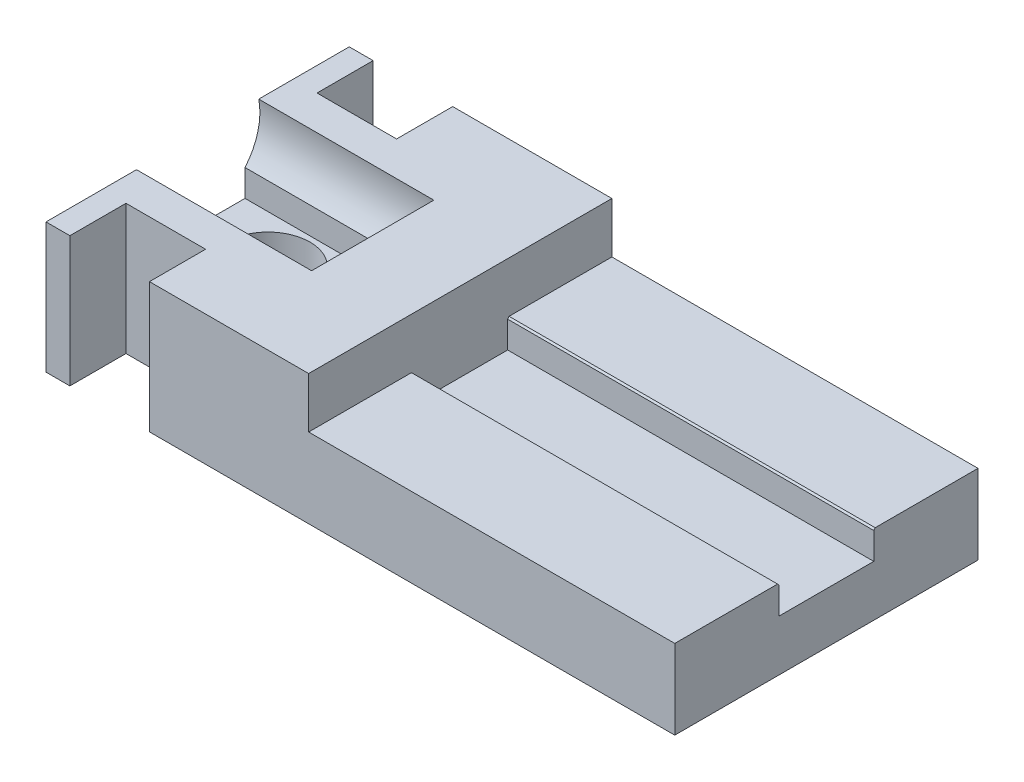
ISO-10303-21;
HEADER;
FILE_DESCRIPTION(('STEP AP214'),'2;1');
FILE_NAME('part.step','',(''),(''),'','','');
FILE_SCHEMA(('AUTOMOTIVE_DESIGN { 1 0 10303 214 1 1 1 1 }'));
ENDSEC;
DATA;
#1=APPLICATION_CONTEXT('core data for automotive mechanical design processes');
#2=APPLICATION_PROTOCOL_DEFINITION('international standard','automotive_design',2000,#1);
#3=PRODUCT_CONTEXT('',#1,'mechanical');
#4=PRODUCT('Part','Part','',(#3));
#5=PRODUCT_RELATED_PRODUCT_CATEGORY('part','',(#4));
#6=PRODUCT_DEFINITION_FORMATION('','',#4);
#7=PRODUCT_DEFINITION_CONTEXT('part definition',#1,'design');
#8=PRODUCT_DEFINITION('design','',#6,#7);
#9=PRODUCT_DEFINITION_SHAPE('','',#8);
#10=(LENGTH_UNIT() NAMED_UNIT(*) SI_UNIT(.MILLI.,.METRE.));
#11=(NAMED_UNIT(*) PLANE_ANGLE_UNIT() SI_UNIT($,.RADIAN.));
#12=(NAMED_UNIT(*) SI_UNIT($,.STERADIAN.) SOLID_ANGLE_UNIT());
#13=UNCERTAINTY_MEASURE_WITH_UNIT(LENGTH_MEASURE(1.E-05),#10,'distance_accuracy_value','');
#14=(GEOMETRIC_REPRESENTATION_CONTEXT(3) GLOBAL_UNCERTAINTY_ASSIGNED_CONTEXT((#13)) GLOBAL_UNIT_ASSIGNED_CONTEXT((#10,
#11,#12)) REPRESENTATION_CONTEXT('',''));
#15=CARTESIAN_POINT('',(0.,0.,0.));
#16=DIRECTION('',(0.,0.,1.));
#17=DIRECTION('',(1.,0.,0.));
#18=AXIS2_PLACEMENT_3D('',#15,#16,#17);
#19=CARTESIAN_POINT('',(-78.,8.49653046712334,-1.07552855510562E-13));
#20=DIRECTION('',(1.,0.,0.));
#21=DIRECTION('',(0.,0.,-1.));
#22=AXIS2_PLACEMENT_3D('',#19,#20,#21);
#23=CYLINDRICAL_SURFACE('',#22,7.8252375772589);
#24=CARTESIAN_POINT('',(-45.,8.49653046712334,-1.07552855510562E-13));
#25=DIRECTION('',(-1.,0.,0.));
#26=DIRECTION('',(0.,0.,1.));
#27=AXIS2_PLACEMENT_3D('',#24,#25,#26);
#28=CIRCLE('',#27,7.8252375772589);
#29=CARTESIAN_POINT('',(-45.,3.41853191527432,-5.95384529929736));
#30=VERTEX_POINT('',#29);
#31=CARTESIAN_POINT('',(-45.,3.63553216923717,-6.13229473268318));
#32=VERTEX_POINT('',#31);
#33=EDGE_CURVE('E205',#30,#32,#28,.F.);
#34=ORIENTED_EDGE('',*,*,#33,.F.);
#35=DIRECTION('',(1.,0.,0.));
#36=VECTOR('',#35,1.);
#37=CARTESIAN_POINT('',(-78.,3.41853191527432,-5.95384529929736));
#38=LINE('',#37,#36);
#39=CARTESIAN_POINT('',(1.,3.41853191527432,-5.95384529929736));
#40=VERTEX_POINT('',#39);
#41=EDGE_CURVE('E212',#40,#30,#38,.F.);
#42=ORIENTED_EDGE('',*,*,#41,.F.);
#43=CARTESIAN_POINT('',(1.,8.49653046712334,-1.07552855510562E-13));
#44=DIRECTION('',(1.,0.,0.));
#45=DIRECTION('',(0.,0.,-1.));
#46=AXIS2_PLACEMENT_3D('',#43,#44,#45);
#47=CIRCLE('',#46,7.8252375772589);
#48=CARTESIAN_POINT('',(1.,3.63553216923717,-6.13229473268318));
#49=VERTEX_POINT('',#48);
#50=EDGE_CURVE('E308',#40,#49,#47,.T.);
#51=ORIENTED_EDGE('',*,*,#50,.T.);
#52=DIRECTION('',(1.,0.,0.));
#53=VECTOR('',#52,1.);
#54=CARTESIAN_POINT('',(-78.,3.63553216923717,-6.13229473268318));
#55=LINE('',#54,#53);
#56=EDGE_CURVE('E215',#32,#49,#55,.T.);
#57=ORIENTED_EDGE('',*,*,#56,.F.);
#58=EDGE_LOOP('',(#34,#42,#51,#57));
#59=FACE_BOUND('',#58,.T.);
#60=ADVANCED_FACE('F32',(#59),#23,.F.);
#61=CARTESIAN_POINT('',(-45.,8.49653046712334,-1.07552855510562E-13));
#62=DIRECTION('',(-1.,0.,0.));
#63=DIRECTION('',(0.,0.,1.));
#64=AXIS2_PLACEMENT_3D('',#61,#62,#63);
#65=CIRCLE('',#64,7.8252375772589);
#66=CARTESIAN_POINT('',(-45.,3.63553216923717,6.13229473268296));
#67=VERTEX_POINT('',#66);
#68=CARTESIAN_POINT('',(-45.,3.41853191527457,5.95384529929736));
#69=VERTEX_POINT('',#68);
#70=EDGE_CURVE('E217',#67,#69,#65,.F.);
#71=ORIENTED_EDGE('',*,*,#70,.F.);
#72=DIRECTION('',(1.,0.,0.));
#73=VECTOR('',#72,1.);
#74=CARTESIAN_POINT('',(-78.,3.63553216923717,6.13229473268296));
#75=LINE('',#74,#73);
#76=CARTESIAN_POINT('',(1.,3.63553216923717,6.13229473268296));
#77=VERTEX_POINT('',#76);
#78=EDGE_CURVE('E312',#77,#67,#75,.F.);
#79=ORIENTED_EDGE('',*,*,#78,.F.);
#80=CARTESIAN_POINT('',(1.,3.41853191527457,5.95384529929736));
#81=VERTEX_POINT('',#80);
#82=EDGE_CURVE('E309',#77,#81,#47,.T.);
#83=ORIENTED_EDGE('',*,*,#82,.T.);
#84=DIRECTION('',(1.,0.,0.));
#85=VECTOR('',#84,1.);
#86=CARTESIAN_POINT('',(-78.,3.41853191527457,5.95384529929736));
#87=LINE('',#86,#85);
#88=EDGE_CURVE('E235',#81,#69,#87,.F.);
#89=ORIENTED_EDGE('',*,*,#88,.T.);
#90=EDGE_LOOP('',(#71,#79,#83,#89));
#91=FACE_BOUND('',#90,.T.);
#92=ADVANCED_FACE('F495',(#91),#23,.F.);
#93=CARTESIAN_POINT('',(1.,0.,5.95384529929736));
#94=DIRECTION('',(0.,0.,1.));
#95=DIRECTION('',(1.,0.,0.));
#96=AXIS2_PLACEMENT_3D('',#93,#94,#95);
#97=PLANE('',#96);
#98=DIRECTION('',(0.,-1.,0.));
#99=VECTOR('',#98,1.);
#100=CARTESIAN_POINT('',(-45.,0.,5.95384529929736));
#101=LINE('',#100,#99);
#102=CARTESIAN_POINT('',(-45.,0.0584346301053529,5.95384529929736));
#103=VERTEX_POINT('',#102);
#104=EDGE_CURVE('E422',#69,#103,#101,.T.);
#105=ORIENTED_EDGE('',*,*,#104,.F.);
#106=ORIENTED_EDGE('',*,*,#88,.F.);
#107=DIRECTION('',(0.,1.,0.));
#108=VECTOR('',#107,1.);
#109=CARTESIAN_POINT('',(1.,0.,5.95384529929736));
#110=LINE('',#109,#108);
#111=CARTESIAN_POINT('',(1.,0.0584346301053529,5.95384529929736));
#112=VERTEX_POINT('',#111);
#113=EDGE_CURVE('E369',#112,#81,#110,.T.);
#114=ORIENTED_EDGE('',*,*,#113,.F.);
#115=DIRECTION('',(-1.,0.,0.));
#116=VECTOR('',#115,1.);
#117=CARTESIAN_POINT('',(1.,0.0584346301053529,5.95384529929736));
#118=LINE('',#117,#116);
#119=EDGE_CURVE('E389',#112,#103,#118,.T.);
#120=ORIENTED_EDGE('',*,*,#119,.T.);
#121=EDGE_LOOP('',(#105,#106,#114,#120));
#122=FACE_BOUND('',#121,.T.);
#123=ADVANCED_FACE('F500',(#122),#97,.F.);
#124=CARTESIAN_POINT('',(1.,0.0584346301053529,0.));
#125=DIRECTION('',(0.,1.,0.));
#126=DIRECTION('',(0.,0.,1.));
#127=AXIS2_PLACEMENT_3D('',#124,#125,#126);
#128=PLANE('',#127);
#129=DIRECTION('',(-1.,0.,0.));
#130=VECTOR('',#129,1.);
#131=CARTESIAN_POINT('',(1.,0.0584346301053529,-5.95384529929736));
#132=LINE('',#131,#130);
#133=CARTESIAN_POINT('',(1.,0.0584346301053529,-5.95384529929736));
#134=VERTEX_POINT('',#133);
#135=CARTESIAN_POINT('',(-45.,0.0584346301053529,-5.95384529929736));
#136=VERTEX_POINT('',#135);
#137=EDGE_CURVE('E54',#134,#136,#132,.T.);
#138=ORIENTED_EDGE('',*,*,#137,.T.);
#139=DIRECTION('',(0.,0.,1.));
#140=VECTOR('',#139,1.);
#141=CARTESIAN_POINT('',(-45.,0.0584346301053529,0.));
#142=LINE('',#141,#140);
#143=EDGE_CURVE('E47',#136,#103,#142,.T.);
#144=ORIENTED_EDGE('',*,*,#143,.T.);
#145=ORIENTED_EDGE('',*,*,#119,.F.);
#146=DIRECTION('',(0.,0.,-1.));
#147=VECTOR('',#146,1.);
#148=CARTESIAN_POINT('',(1.,0.0584346301053529,0.));
#149=LINE('',#148,#147);
#150=EDGE_CURVE('E384',#112,#134,#149,.T.);
#151=ORIENTED_EDGE('',*,*,#150,.T.);
#152=EDGE_LOOP('',(#138,#144,#145,#151));
#153=FACE_BOUND('',#152,.T.);
#154=ADVANCED_FACE('F518',(#153),#128,.T.);
#155=CARTESIAN_POINT('',(1.,0.,-5.95384529929736));
#156=DIRECTION('',(0.,0.,1.));
#157=DIRECTION('',(1.,0.,0.));
#158=AXIS2_PLACEMENT_3D('',#155,#156,#157);
#159=PLANE('',#158);
#160=ORIENTED_EDGE('',*,*,#41,.T.);
#161=DIRECTION('',(0.,-1.,0.));
#162=VECTOR('',#161,1.);
#163=CARTESIAN_POINT('',(-45.,0.,-5.95384529929736));
#164=LINE('',#163,#162);
#165=EDGE_CURVE('E40',#30,#136,#164,.T.);
#166=ORIENTED_EDGE('',*,*,#165,.T.);
#167=ORIENTED_EDGE('',*,*,#137,.F.);
#168=DIRECTION('',(0.,1.,0.));
#169=VECTOR('',#168,1.);
#170=CARTESIAN_POINT('',(1.,0.,-5.95384529929736));
#171=LINE('',#170,#169);
#172=EDGE_CURVE('E221',#134,#40,#171,.T.);
#173=ORIENTED_EDGE('',*,*,#172,.T.);
#174=EDGE_LOOP('',(#160,#166,#167,#173));
#175=FACE_BOUND('',#174,.T.);
#176=ADVANCED_FACE('F219',(#175),#159,.T.);
#177=CARTESIAN_POINT('',(-56.,3.41853191527432,-5.95384529929736));
#178=VERTEX_POINT('',#177);
#179=CARTESIAN_POINT('',(-78.,3.41853191527432,-5.95384529929736));
#180=VERTEX_POINT('',#179);
#181=EDGE_CURVE('E223',#178,#180,#38,.F.);
#182=ORIENTED_EDGE('',*,*,#181,.F.);
#183=CARTESIAN_POINT('',(-56.,8.49653046712334,-1.07552855510562E-13));
#184=DIRECTION('',(-1.,0.,0.));
#185=DIRECTION('',(0.,0.,1.));
#186=AXIS2_PLACEMENT_3D('',#183,#184,#185);
#187=CIRCLE('',#186,7.8252375772589);
#188=CARTESIAN_POINT('',(-56.,10.,-7.6794480598711));
#189=VERTEX_POINT('',#188);
#190=EDGE_CURVE('E365',#178,#189,#187,.F.);
#191=ORIENTED_EDGE('',*,*,#190,.T.);
#192=DIRECTION('',(1.,0.,0.));
#193=VECTOR('',#192,1.);
#194=CARTESIAN_POINT('',(-78.,10.,-7.6794480598711));
#195=LINE('',#194,#193);
#196=CARTESIAN_POINT('',(-78.,10.,-7.6794480598711));
#197=VERTEX_POINT('',#196);
#198=EDGE_CURVE('E353',#197,#189,#195,.T.);
#199=ORIENTED_EDGE('',*,*,#198,.F.);
#200=CARTESIAN_POINT('',(-78.,8.49653046712334,-1.07552855510562E-13));
#201=DIRECTION('',(1.,0.,0.));
#202=DIRECTION('',(0.,0.,-1.));
#203=AXIS2_PLACEMENT_3D('',#200,#201,#202);
#204=CIRCLE('',#203,7.8252375772589);
#205=EDGE_CURVE('E283',#180,#197,#204,.T.);
#206=ORIENTED_EDGE('',*,*,#205,.F.);
#207=EDGE_LOOP('',(#182,#191,#199,#206));
#208=FACE_BOUND('',#207,.T.);
#209=ADVANCED_FACE('F432',(#208),#23,.F.);
#210=CARTESIAN_POINT('',(-78.,-6.35,19.05));
#211=DIRECTION('',(0.,0.,1.));
#212=DIRECTION('',(0.,-1.,0.));
#213=AXIS2_PLACEMENT_3D('',#210,#211,#212);
#214=PLANE('',#213);
#215=DIRECTION('',(0.,-1.,0.));
#216=VECTOR('',#215,1.);
#217=CARTESIAN_POINT('',(-75.,-6.35,19.05));
#218=LINE('',#217,#216);
#219=CARTESIAN_POINT('',(-75.,10.,19.05));
#220=VERTEX_POINT('',#219);
#221=CARTESIAN_POINT('',(-75.,-6.35,19.05));
#222=VERTEX_POINT('',#221);
#223=EDGE_CURVE('E281',#220,#222,#218,.T.);
#224=ORIENTED_EDGE('',*,*,#223,.F.);
#225=DIRECTION('',(1.,0.,0.));
#226=VECTOR('',#225,1.);
#227=CARTESIAN_POINT('',(-78.,10.,19.05));
#228=LINE('',#227,#226);
#229=CARTESIAN_POINT('',(-78.,10.,19.05));
#230=VERTEX_POINT('',#229);
#231=EDGE_CURVE('E292',#230,#220,#228,.T.);
#232=ORIENTED_EDGE('',*,*,#231,.F.);
#233=DIRECTION('',(0.,-1.,0.));
#234=VECTOR('',#233,1.);
#235=CARTESIAN_POINT('',(-78.,-6.35,19.05));
#236=LINE('',#235,#234);
#237=CARTESIAN_POINT('',(-78.,-6.35,19.05));
#238=VERTEX_POINT('',#237);
#239=EDGE_CURVE('E339',#230,#238,#236,.T.);
#240=ORIENTED_EDGE('',*,*,#239,.T.);
#241=DIRECTION('',(1.,0.,0.));
#242=VECTOR('',#241,1.);
#243=CARTESIAN_POINT('',(-78.,-6.35,19.05));
#244=LINE('',#243,#242);
#245=EDGE_CURVE('E342',#238,#222,#244,.T.);
#246=ORIENTED_EDGE('',*,*,#245,.T.);
#247=EDGE_LOOP('',(#224,#232,#240,#246));
#248=FACE_BOUND('',#247,.T.);
#249=ADVANCED_FACE('F444',(#248),#214,.T.);
#250=CARTESIAN_POINT('',(-78.,-6.34999999999999,-19.05));
#251=DIRECTION('',(0.,0.,-1.));
#252=DIRECTION('',(0.,1.,0.));
#253=AXIS2_PLACEMENT_3D('',#250,#251,#252);
#254=PLANE('',#253);
#255=DIRECTION('',(0.,1.,0.));
#256=VECTOR('',#255,1.);
#257=CARTESIAN_POINT('',(-75.,-6.34999999999999,-19.05));
#258=LINE('',#257,#256);
#259=CARTESIAN_POINT('',(-75.,-6.35,-19.05));
#260=VERTEX_POINT('',#259);
#261=CARTESIAN_POINT('',(-75.,10.,-19.05));
#262=VERTEX_POINT('',#261);
#263=EDGE_CURVE('E208',#260,#262,#258,.T.);
#264=ORIENTED_EDGE('',*,*,#263,.F.);
#265=DIRECTION('',(1.,0.,0.));
#266=VECTOR('',#265,1.);
#267=CARTESIAN_POINT('',(-78.,-6.34999999999999,-19.05));
#268=LINE('',#267,#266);
#269=CARTESIAN_POINT('',(-78.,-6.34999999999999,-19.05));
#270=VERTEX_POINT('',#269);
#271=EDGE_CURVE('E347',#270,#260,#268,.T.);
#272=ORIENTED_EDGE('',*,*,#271,.F.);
#273=DIRECTION('',(0.,1.,0.));
#274=VECTOR('',#273,1.);
#275=CARTESIAN_POINT('',(-78.,-6.34999999999999,-19.05));
#276=LINE('',#275,#274);
#277=CARTESIAN_POINT('',(-78.,10.,-19.05));
#278=VERTEX_POINT('',#277);
#279=EDGE_CURVE('E336',#270,#278,#276,.T.);
#280=ORIENTED_EDGE('',*,*,#279,.T.);
#281=DIRECTION('',(-1.,0.,0.));
#282=VECTOR('',#281,1.);
#283=CARTESIAN_POINT('',(-78.,10.,-19.05));
#284=LINE('',#283,#282);
#285=EDGE_CURVE('E297',#262,#278,#284,.T.);
#286=ORIENTED_EDGE('',*,*,#285,.F.);
#287=EDGE_LOOP('',(#264,#272,#280,#286));
#288=FACE_BOUND('',#287,.T.);
#289=ADVANCED_FACE('F482',(#288),#254,.T.);
#290=DIRECTION('',(1.,0.,0.));
#291=VECTOR('',#290,1.);
#292=CARTESIAN_POINT('',(-78.,10.,7.67944805987088));
#293=LINE('',#292,#291);
#294=CARTESIAN_POINT('',(-56.,10.,7.67944805987088));
#295=VERTEX_POINT('',#294);
#296=CARTESIAN_POINT('',(-78.,10.,7.67944805987089));
#297=VERTEX_POINT('',#296);
#298=EDGE_CURVE('E351',#295,#297,#293,.F.);
#299=ORIENTED_EDGE('',*,*,#298,.F.);
#300=CARTESIAN_POINT('',(-56.,8.49653046712334,-1.07552855510562E-13));
#301=DIRECTION('',(-1.,0.,0.));
#302=DIRECTION('',(0.,0.,1.));
#303=AXIS2_PLACEMENT_3D('',#300,#301,#302);
#304=CIRCLE('',#303,7.8252375772589);
#305=CARTESIAN_POINT('',(-56.,3.41853191527457,5.95384529929736));
#306=VERTEX_POINT('',#305);
#307=EDGE_CURVE('E372',#295,#306,#304,.F.);
#308=ORIENTED_EDGE('',*,*,#307,.T.);
#309=CARTESIAN_POINT('',(-78.,3.41853191527457,5.95384529929736));
#310=VERTEX_POINT('',#309);
#311=EDGE_CURVE('E234',#306,#310,#87,.F.);
#312=ORIENTED_EDGE('',*,*,#311,.T.);
#313=EDGE_CURVE('E284',#297,#310,#204,.T.);
#314=ORIENTED_EDGE('',*,*,#313,.F.);
#315=EDGE_LOOP('',(#299,#308,#312,#314));
#316=FACE_BOUND('',#315,.T.);
#317=ADVANCED_FACE('F414',(#316),#23,.F.);
#318=CARTESIAN_POINT('',(-68.,3.63553216923717,-19.05));
#319=DIRECTION('',(0.,-1.,0.));
#320=DIRECTION('',(0.,0.,-1.));
#321=AXIS2_PLACEMENT_3D('',#318,#319,#320);
#322=PLANE('',#321);
#323=DIRECTION('',(0.,0.,-1.));
#324=VECTOR('',#323,1.);
#325=CARTESIAN_POINT('',(-45.,3.63553216923717,-19.05));
#326=LINE('',#325,#324);
#327=CARTESIAN_POINT('',(-45.,3.63553216923717,-19.05));
#328=VERTEX_POINT('',#327);
#329=EDGE_CURVE('E306',#32,#328,#326,.T.);
#330=ORIENTED_EDGE('',*,*,#329,.F.);
#331=ORIENTED_EDGE('',*,*,#56,.T.);
#332=DIRECTION('',(0.,0.,1.));
#333=VECTOR('',#332,1.);
#334=CARTESIAN_POINT('',(1.,3.63553216923717,-19.05));
#335=LINE('',#334,#333);
#336=CARTESIAN_POINT('',(1.,3.63553216923717,-19.05));
#337=VERTEX_POINT('',#336);
#338=EDGE_CURVE('E321',#337,#49,#335,.T.);
#339=ORIENTED_EDGE('',*,*,#338,.F.);
#340=DIRECTION('',(1.,0.,0.));
#341=VECTOR('',#340,1.);
#342=CARTESIAN_POINT('',(-68.,3.63553216923717,-19.05));
#343=LINE('',#342,#341);
#344=EDGE_CURVE('E317',#328,#337,#343,.T.);
#345=ORIENTED_EDGE('',*,*,#344,.F.);
#346=EDGE_LOOP('',(#330,#331,#339,#345));
#347=FACE_BOUND('',#346,.T.);
#348=ADVANCED_FACE('F505',(#347),#322,.F.);
#349=DIRECTION('',(0.,0.,-1.));
#350=VECTOR('',#349,1.);
#351=CARTESIAN_POINT('',(-45.,3.63553216923717,-19.05));
#352=LINE('',#351,#350);
#353=CARTESIAN_POINT('',(-45.,3.63553216923717,19.05));
#354=VERTEX_POINT('',#353);
#355=EDGE_CURVE('E345',#354,#67,#352,.T.);
#356=ORIENTED_EDGE('',*,*,#355,.F.);
#357=DIRECTION('',(1.,0.,0.));
#358=VECTOR('',#357,1.);
#359=CARTESIAN_POINT('',(-68.,3.63553216923717,19.05));
#360=LINE('',#359,#358);
#361=CARTESIAN_POINT('',(1.,3.63553216923717,19.05));
#362=VERTEX_POINT('',#361);
#363=EDGE_CURVE('E316',#354,#362,#360,.T.);
#364=ORIENTED_EDGE('',*,*,#363,.T.);
#365=EDGE_CURVE('E319',#77,#362,#335,.T.);
#366=ORIENTED_EDGE('',*,*,#365,.F.);
#367=ORIENTED_EDGE('',*,*,#78,.T.);
#368=EDGE_LOOP('',(#356,#364,#366,#367));
#369=FACE_BOUND('',#368,.T.);
#370=ADVANCED_FACE('F510',(#369),#322,.F.);
#371=CARTESIAN_POINT('',(-65.,-6.35,19.05));
#372=VERTEX_POINT('',#371);
#373=CARTESIAN_POINT('',(1.,-6.35,19.05));
#374=VERTEX_POINT('',#373);
#375=EDGE_CURVE('E346',#372,#374,#244,.T.);
#376=ORIENTED_EDGE('',*,*,#375,.T.);
#377=DIRECTION('',(0.,-1.,0.));
#378=VECTOR('',#377,1.);
#379=CARTESIAN_POINT('',(1.,-6.35,19.05));
#380=LINE('',#379,#378);
#381=EDGE_CURVE('E330',#362,#374,#380,.T.);
#382=ORIENTED_EDGE('',*,*,#381,.F.);
#383=ORIENTED_EDGE('',*,*,#363,.F.);
#384=DIRECTION('',(0.,-1.,0.));
#385=VECTOR('',#384,1.);
#386=CARTESIAN_POINT('',(-45.,10.,19.05));
#387=LINE('',#386,#385);
#388=CARTESIAN_POINT('',(-45.,10.,19.05));
#389=VERTEX_POINT('',#388);
#390=EDGE_CURVE('E303',#389,#354,#387,.T.);
#391=ORIENTED_EDGE('',*,*,#390,.F.);
#392=CARTESIAN_POINT('',(-65.,10.,19.05));
#393=VERTEX_POINT('',#392);
#394=EDGE_CURVE('E291',#393,#389,#228,.T.);
#395=ORIENTED_EDGE('',*,*,#394,.F.);
#396=DIRECTION('',(0.,1.,0.));
#397=VECTOR('',#396,1.);
#398=CARTESIAN_POINT('',(-65.,-6.35,19.05));
#399=LINE('',#398,#397);
#400=EDGE_CURVE('E257',#372,#393,#399,.T.);
#401=ORIENTED_EDGE('',*,*,#400,.F.);
#402=EDGE_LOOP('',(#376,#382,#383,#391,#395,#401));
#403=FACE_BOUND('',#402,.T.);
#404=ADVANCED_FACE('F459',(#403),#214,.T.);
#405=CARTESIAN_POINT('',(-78.,0.,0.));
#406=DIRECTION('',(1.,0.,0.));
#407=DIRECTION('',(0.,0.,-1.));
#408=AXIS2_PLACEMENT_3D('',#405,#406,#407);
#409=PLANE('',#408);
#410=ORIENTED_EDGE('',*,*,#313,.T.);
#411=DIRECTION('',(0.,-1.,0.));
#412=VECTOR('',#411,1.);
#413=CARTESIAN_POINT('',(-78.,0.,5.95384529929736));
#414=LINE('',#413,#412);
#415=CARTESIAN_POINT('',(-78.,0.0584346301053529,5.95384529929736));
#416=VERTEX_POINT('',#415);
#417=EDGE_CURVE('E226',#310,#416,#414,.T.);
#418=ORIENTED_EDGE('',*,*,#417,.T.);
#419=DIRECTION('',(0.,0.,1.));
#420=VECTOR('',#419,1.);
#421=CARTESIAN_POINT('',(-78.,0.0584346301053529,0.));
#422=LINE('',#421,#420);
#423=CARTESIAN_POINT('',(-78.,0.0584346301053529,-5.95384529929736));
#424=VERTEX_POINT('',#423);
#425=EDGE_CURVE('E222',#424,#416,#422,.T.);
#426=ORIENTED_EDGE('',*,*,#425,.F.);
#427=DIRECTION('',(0.,-1.,0.));
#428=VECTOR('',#427,1.);
#429=CARTESIAN_POINT('',(-78.,0.,-5.95384529929736));
#430=LINE('',#429,#428);
#431=EDGE_CURVE('E228',#180,#424,#430,.T.);
#432=ORIENTED_EDGE('',*,*,#431,.F.);
#433=ORIENTED_EDGE('',*,*,#205,.T.);
#434=DIRECTION('',(0.,0.,1.));
#435=VECTOR('',#434,1.);
#436=CARTESIAN_POINT('',(-78.,10.,19.05));
#437=LINE('',#436,#435);
#438=EDGE_CURVE('E288',#278,#197,#437,.T.);
#439=ORIENTED_EDGE('',*,*,#438,.F.);
#440=ORIENTED_EDGE('',*,*,#279,.F.);
#441=DIRECTION('',(0.,0.,-1.));
#442=VECTOR('',#441,1.);
#443=CARTESIAN_POINT('',(-78.,-6.35,19.05));
#444=LINE('',#443,#442);
#445=EDGE_CURVE('E333',#238,#270,#444,.T.);
#446=ORIENTED_EDGE('',*,*,#445,.F.);
#447=ORIENTED_EDGE('',*,*,#239,.F.);
#448=EDGE_CURVE('E287',#297,#230,#437,.T.);
#449=ORIENTED_EDGE('',*,*,#448,.F.);
#450=EDGE_LOOP('',(#410,#418,#426,#432,#433,#439,#440,#446,#447,#449));
#451=FACE_BOUND('',#450,.T.);
#452=ADVANCED_FACE('F408',(#451),#409,.F.);
#453=CARTESIAN_POINT('',(-78.,-6.35,19.05));
#454=DIRECTION('',(0.,-1.,0.));
#455=DIRECTION('',(0.,0.,-1.));
#456=AXIS2_PLACEMENT_3D('',#453,#454,#455);
#457=PLANE('',#456);
#458=CARTESIAN_POINT('',(-65.,-6.35,-19.05));
#459=VERTEX_POINT('',#458);
#460=CARTESIAN_POINT('',(1.,-6.34999999999999,-19.05));
#461=VERTEX_POINT('',#460);
#462=EDGE_CURVE('E341',#459,#461,#268,.T.);
#463=ORIENTED_EDGE('',*,*,#462,.T.);
#464=DIRECTION('',(0.,0.,-1.));
#465=VECTOR('',#464,1.);
#466=CARTESIAN_POINT('',(1.,-6.35,19.05));
#467=LINE('',#466,#465);
#468=EDGE_CURVE('E324',#374,#461,#467,.T.);
#469=ORIENTED_EDGE('',*,*,#468,.F.);
#470=ORIENTED_EDGE('',*,*,#375,.F.);
#471=DIRECTION('',(0.,0.,-1.));
#472=VECTOR('',#471,1.);
#473=CARTESIAN_POINT('',(-65.,-6.35,37.4));
#474=LINE('',#473,#472);
#475=CARTESIAN_POINT('',(-65.,-6.35,12.));
#476=VERTEX_POINT('',#475);
#477=EDGE_CURVE('E245',#372,#476,#474,.T.);
#478=ORIENTED_EDGE('',*,*,#477,.T.);
#479=DIRECTION('',(-1.,0.,0.));
#480=VECTOR('',#479,1.);
#481=CARTESIAN_POINT('',(-65.,-6.35,12.));
#482=LINE('',#481,#480);
#483=CARTESIAN_POINT('',(-75.,-6.35,12.));
#484=VERTEX_POINT('',#483);
#485=EDGE_CURVE('E248',#476,#484,#482,.T.);
#486=ORIENTED_EDGE('',*,*,#485,.T.);
#487=DIRECTION('',(0.,0.,1.));
#488=VECTOR('',#487,1.);
#489=CARTESIAN_POINT('',(-75.,-6.35,12.));
#490=LINE('',#489,#488);
#491=EDGE_CURVE('E251',#484,#222,#490,.T.);
#492=ORIENTED_EDGE('',*,*,#491,.T.);
#493=ORIENTED_EDGE('',*,*,#245,.F.);
#494=ORIENTED_EDGE('',*,*,#445,.T.);
#495=ORIENTED_EDGE('',*,*,#271,.T.);
#496=DIRECTION('',(0.,0.,1.));
#497=VECTOR('',#496,1.);
#498=CARTESIAN_POINT('',(-75.,-6.35,-12.));
#499=LINE('',#498,#497);
#500=CARTESIAN_POINT('',(-75.,-6.35,-12.));
#501=VERTEX_POINT('',#500);
#502=EDGE_CURVE('E267',#260,#501,#499,.T.);
#503=ORIENTED_EDGE('',*,*,#502,.T.);
#504=DIRECTION('',(1.,0.,0.));
#505=VECTOR('',#504,1.);
#506=CARTESIAN_POINT('',(-65.,-6.35,-12.));
#507=LINE('',#506,#505);
#508=CARTESIAN_POINT('',(-65.,-6.35,-12.));
#509=VERTEX_POINT('',#508);
#510=EDGE_CURVE('E270',#501,#509,#507,.T.);
#511=ORIENTED_EDGE('',*,*,#510,.T.);
#512=DIRECTION('',(0.,0.,-1.));
#513=VECTOR('',#512,1.);
#514=CARTESIAN_POINT('',(-65.,-6.35,-37.4));
#515=LINE('',#514,#513);
#516=EDGE_CURVE('E273',#509,#459,#515,.T.);
#517=ORIENTED_EDGE('',*,*,#516,.T.);
#518=EDGE_LOOP('',(#463,#469,#470,#478,#486,#492,#493,#494,#495,#503,#511,#517));
#519=FACE_BOUND('',#518,.T.);
#520=CARTESIAN_POINT('',(-69.1697419062874,-6.34999999999999,-8.73866951023317E-12));
#521=DIRECTION('',(0.,-1.,0.));
#522=DIRECTION('',(0.,0.,-1.));
#523=AXIS2_PLACEMENT_3D('',#520,#521,#522);
#524=CIRCLE('',#523,5.28052931781871);
#525=CARTESIAN_POINT('',(-69.1697419062874,-6.34999999999999,-5.28052931782745));
#526=VERTEX_POINT('',#525);
#527=EDGE_CURVE('E364',#526,#526,#524,.F.);
#528=ORIENTED_EDGE('',*,*,#527,.T.);
#529=EDGE_LOOP('',(#528));
#530=FACE_BOUND('',#529,.T.);
#531=ADVANCED_FACE('F34',(#519,#530),#457,.T.);
#532=DIRECTION('',(0.,-1.,0.));
#533=VECTOR('',#532,1.);
#534=CARTESIAN_POINT('',(-65.,-6.34999999999999,-19.05));
#535=LINE('',#534,#533);
#536=CARTESIAN_POINT('',(-65.,10.,-19.05));
#537=VERTEX_POINT('',#536);
#538=EDGE_CURVE('E359',#537,#459,#535,.T.);
#539=ORIENTED_EDGE('',*,*,#538,.F.);
#540=CARTESIAN_POINT('',(-45.,10.,-19.05));
#541=VERTEX_POINT('',#540);
#542=EDGE_CURVE('E298',#541,#537,#284,.T.);
#543=ORIENTED_EDGE('',*,*,#542,.F.);
#544=DIRECTION('',(0.,-1.,0.));
#545=VECTOR('',#544,1.);
#546=CARTESIAN_POINT('',(-45.,10.,-19.05));
#547=LINE('',#546,#545);
#548=EDGE_CURVE('E300',#541,#328,#547,.T.);
#549=ORIENTED_EDGE('',*,*,#548,.T.);
#550=ORIENTED_EDGE('',*,*,#344,.T.);
#551=DIRECTION('',(0.,1.,0.));
#552=VECTOR('',#551,1.);
#553=CARTESIAN_POINT('',(1.,-6.34999999999999,-19.05));
#554=LINE('',#553,#552);
#555=EDGE_CURVE('E327',#461,#337,#554,.T.);
#556=ORIENTED_EDGE('',*,*,#555,.F.);
#557=ORIENTED_EDGE('',*,*,#462,.F.);
#558=EDGE_LOOP('',(#539,#543,#549,#550,#556,#557));
#559=FACE_BOUND('',#558,.T.);
#560=ADVANCED_FACE('F474',(#559),#254,.T.);
#561=CARTESIAN_POINT('',(1.,0.,0.));
#562=DIRECTION('',(1.,0.,0.));
#563=DIRECTION('',(0.,0.,-1.));
#564=AXIS2_PLACEMENT_3D('',#561,#562,#563);
#565=PLANE('',#564);
#566=ORIENTED_EDGE('',*,*,#113,.T.);
#567=ORIENTED_EDGE('',*,*,#82,.F.);
#568=ORIENTED_EDGE('',*,*,#365,.T.);
#569=ORIENTED_EDGE('',*,*,#381,.T.);
#570=ORIENTED_EDGE('',*,*,#468,.T.);
#571=ORIENTED_EDGE('',*,*,#555,.T.);
#572=ORIENTED_EDGE('',*,*,#338,.T.);
#573=ORIENTED_EDGE('',*,*,#50,.F.);
#574=ORIENTED_EDGE('',*,*,#172,.F.);
#575=ORIENTED_EDGE('',*,*,#150,.F.);
#576=EDGE_LOOP('',(#566,#567,#568,#569,#570,#571,#572,#573,#574,#575));
#577=FACE_BOUND('',#576,.T.);
#578=ADVANCED_FACE('F585',(#577),#565,.T.);
#579=CARTESIAN_POINT('',(-45.,10.,19.05));
#580=DIRECTION('',(-1.,0.,0.));
#581=DIRECTION('',(0.,0.,1.));
#582=AXIS2_PLACEMENT_3D('',#579,#580,#581);
#583=PLANE('',#582);
#584=ORIENTED_EDGE('',*,*,#355,.T.);
#585=ORIENTED_EDGE('',*,*,#70,.T.);
#586=ORIENTED_EDGE('',*,*,#104,.T.);
#587=ORIENTED_EDGE('',*,*,#143,.F.);
#588=ORIENTED_EDGE('',*,*,#165,.F.);
#589=ORIENTED_EDGE('',*,*,#33,.T.);
#590=ORIENTED_EDGE('',*,*,#329,.T.);
#591=ORIENTED_EDGE('',*,*,#548,.F.);
#592=DIRECTION('',(0.,0.,-1.));
#593=VECTOR('',#592,1.);
#594=CARTESIAN_POINT('',(-45.,10.,19.05));
#595=LINE('',#594,#593);
#596=EDGE_CURVE('E295',#389,#541,#595,.T.);
#597=ORIENTED_EDGE('',*,*,#596,.F.);
#598=ORIENTED_EDGE('',*,*,#390,.T.);
#599=EDGE_LOOP('',(#584,#585,#586,#587,#588,#589,#590,#591,#597,#598));
#600=FACE_BOUND('',#599,.T.);
#601=ADVANCED_FACE('F203',(#600),#583,.F.);
#602=CARTESIAN_POINT('',(0.,10.,0.));
#603=DIRECTION('',(0.,-1.,0.));
#604=DIRECTION('',(0.,0.,-1.));
#605=AXIS2_PLACEMENT_3D('',#602,#603,#604);
#606=PLANE('',#605);
#607=ORIENTED_EDGE('',*,*,#394,.T.);
#608=ORIENTED_EDGE('',*,*,#596,.T.);
#609=ORIENTED_EDGE('',*,*,#542,.T.);
#610=DIRECTION('',(0.,0.,-1.));
#611=VECTOR('',#610,1.);
#612=CARTESIAN_POINT('',(-65.,10.,-37.4));
#613=LINE('',#612,#611);
#614=CARTESIAN_POINT('',(-65.,10.,-12.));
#615=VERTEX_POINT('',#614);
#616=EDGE_CURVE('E264',#615,#537,#613,.T.);
#617=ORIENTED_EDGE('',*,*,#616,.F.);
#618=DIRECTION('',(1.,0.,0.));
#619=VECTOR('',#618,1.);
#620=CARTESIAN_POINT('',(-65.,10.,-12.));
#621=LINE('',#620,#619);
#622=CARTESIAN_POINT('',(-75.,10.,-12.));
#623=VERTEX_POINT('',#622);
#624=EDGE_CURVE('E261',#623,#615,#621,.T.);
#625=ORIENTED_EDGE('',*,*,#624,.F.);
#626=DIRECTION('',(0.,0.,1.));
#627=VECTOR('',#626,1.);
#628=CARTESIAN_POINT('',(-75.,10.,-12.));
#629=LINE('',#628,#627);
#630=EDGE_CURVE('E238',#262,#623,#629,.T.);
#631=ORIENTED_EDGE('',*,*,#630,.F.);
#632=ORIENTED_EDGE('',*,*,#285,.T.);
#633=ORIENTED_EDGE('',*,*,#438,.T.);
#634=ORIENTED_EDGE('',*,*,#198,.T.);
#635=DIRECTION('',(0.,0.,1.));
#636=VECTOR('',#635,1.);
#637=CARTESIAN_POINT('',(-56.,10.,-19.05));
#638=LINE('',#637,#636);
#639=EDGE_CURVE('E418',#189,#295,#638,.T.);
#640=ORIENTED_EDGE('',*,*,#639,.T.);
#641=ORIENTED_EDGE('',*,*,#298,.T.);
#642=ORIENTED_EDGE('',*,*,#448,.T.);
#643=ORIENTED_EDGE('',*,*,#231,.T.);
#644=DIRECTION('',(0.,0.,1.));
#645=VECTOR('',#644,1.);
#646=CARTESIAN_POINT('',(-75.,10.,12.));
#647=LINE('',#646,#645);
#648=CARTESIAN_POINT('',(-75.,10.,12.));
#649=VERTEX_POINT('',#648);
#650=EDGE_CURVE('E242',#649,#220,#647,.T.);
#651=ORIENTED_EDGE('',*,*,#650,.F.);
#652=DIRECTION('',(-1.,0.,0.));
#653=VECTOR('',#652,1.);
#654=CARTESIAN_POINT('',(-65.,10.,12.));
#655=LINE('',#654,#653);
#656=CARTESIAN_POINT('',(-65.,10.,12.));
#657=VERTEX_POINT('',#656);
#658=EDGE_CURVE('E239',#657,#649,#655,.T.);
#659=ORIENTED_EDGE('',*,*,#658,.F.);
#660=DIRECTION('',(0.,0.,1.));
#661=VECTOR('',#660,1.);
#662=CARTESIAN_POINT('',(-65.,10.,0.));
#663=LINE('',#662,#661);
#664=EDGE_CURVE('E356',#657,#393,#663,.T.);
#665=ORIENTED_EDGE('',*,*,#664,.T.);
#666=EDGE_LOOP('',(#607,#608,#609,#617,#625,#631,#632,#633,#634,#640,#641,#642,#643,#651,#659,#665));
#667=FACE_BOUND('',#666,.T.);
#668=ADVANCED_FACE('F420',(#667),#606,.F.);
#669=CARTESIAN_POINT('',(-75.,-6.35,12.));
#670=DIRECTION('',(-1.,0.,0.));
#671=DIRECTION('',(0.,0.,1.));
#672=AXIS2_PLACEMENT_3D('',#669,#670,#671);
#673=PLANE('',#672);
#674=ORIENTED_EDGE('',*,*,#223,.T.);
#675=ORIENTED_EDGE('',*,*,#491,.F.);
#676=DIRECTION('',(0.,1.,0.));
#677=VECTOR('',#676,1.);
#678=CARTESIAN_POINT('',(-75.,-6.35,12.));
#679=LINE('',#678,#677);
#680=EDGE_CURVE('E255',#484,#649,#679,.T.);
#681=ORIENTED_EDGE('',*,*,#680,.T.);
#682=ORIENTED_EDGE('',*,*,#650,.T.);
#683=EDGE_LOOP('',(#674,#675,#681,#682));
#684=FACE_BOUND('',#683,.T.);
#685=ADVANCED_FACE('F449',(#684),#673,.F.);
#686=CARTESIAN_POINT('',(-65.,-6.35,12.));
#687=DIRECTION('',(0.,0.,-1.));
#688=DIRECTION('',(-1.,0.,0.));
#689=AXIS2_PLACEMENT_3D('',#686,#687,#688);
#690=PLANE('',#689);
#691=ORIENTED_EDGE('',*,*,#680,.F.);
#692=ORIENTED_EDGE('',*,*,#485,.F.);
#693=DIRECTION('',(0.,1.,0.));
#694=VECTOR('',#693,1.);
#695=CARTESIAN_POINT('',(-65.,-6.35,12.));
#696=LINE('',#695,#694);
#697=EDGE_CURVE('E254',#476,#657,#696,.T.);
#698=ORIENTED_EDGE('',*,*,#697,.T.);
#699=ORIENTED_EDGE('',*,*,#658,.T.);
#700=EDGE_LOOP('',(#691,#692,#698,#699));
#701=FACE_BOUND('',#700,.T.);
#702=ADVANCED_FACE('F452',(#701),#690,.F.);
#703=CARTESIAN_POINT('',(-65.,-6.35,37.4));
#704=DIRECTION('',(1.,0.,0.));
#705=DIRECTION('',(0.,0.,-1.));
#706=AXIS2_PLACEMENT_3D('',#703,#704,#705);
#707=PLANE('',#706);
#708=ORIENTED_EDGE('',*,*,#400,.T.);
#709=ORIENTED_EDGE('',*,*,#664,.F.);
#710=ORIENTED_EDGE('',*,*,#697,.F.);
#711=ORIENTED_EDGE('',*,*,#477,.F.);
#712=EDGE_LOOP('',(#708,#709,#710,#711));
#713=FACE_BOUND('',#712,.T.);
#714=ADVANCED_FACE('F454',(#713),#707,.F.);
#715=CARTESIAN_POINT('',(-75.,-6.35,-12.));
#716=DIRECTION('',(-1.,0.,0.));
#717=DIRECTION('',(0.,0.,1.));
#718=AXIS2_PLACEMENT_3D('',#715,#716,#717);
#719=PLANE('',#718);
#720=ORIENTED_EDGE('',*,*,#263,.T.);
#721=ORIENTED_EDGE('',*,*,#630,.T.);
#722=DIRECTION('',(0.,1.,0.));
#723=VECTOR('',#722,1.);
#724=CARTESIAN_POINT('',(-75.,-6.35,-12.));
#725=LINE('',#724,#723);
#726=EDGE_CURVE('E276',#501,#623,#725,.T.);
#727=ORIENTED_EDGE('',*,*,#726,.F.);
#728=ORIENTED_EDGE('',*,*,#502,.F.);
#729=EDGE_LOOP('',(#720,#721,#727,#728));
#730=FACE_BOUND('',#729,.T.);
#731=ADVANCED_FACE('F483',(#730),#719,.F.);
#732=CARTESIAN_POINT('',(-65.,-6.35,-37.4));
#733=DIRECTION('',(1.,0.,0.));
#734=DIRECTION('',(0.,0.,-1.));
#735=AXIS2_PLACEMENT_3D('',#732,#733,#734);
#736=PLANE('',#735);
#737=ORIENTED_EDGE('',*,*,#538,.T.);
#738=ORIENTED_EDGE('',*,*,#516,.F.);
#739=DIRECTION('',(0.,1.,0.));
#740=VECTOR('',#739,1.);
#741=CARTESIAN_POINT('',(-65.,-6.35,-12.));
#742=LINE('',#741,#740);
#743=EDGE_CURVE('E243',#509,#615,#742,.T.);
#744=ORIENTED_EDGE('',*,*,#743,.T.);
#745=ORIENTED_EDGE('',*,*,#616,.T.);
#746=EDGE_LOOP('',(#737,#738,#744,#745));
#747=FACE_BOUND('',#746,.T.);
#748=ADVANCED_FACE('F471',(#747),#736,.F.);
#749=CARTESIAN_POINT('',(-65.,-6.35,-12.));
#750=DIRECTION('',(0.,0.,1.));
#751=DIRECTION('',(1.,0.,0.));
#752=AXIS2_PLACEMENT_3D('',#749,#750,#751);
#753=PLANE('',#752);
#754=ORIENTED_EDGE('',*,*,#743,.F.);
#755=ORIENTED_EDGE('',*,*,#510,.F.);
#756=ORIENTED_EDGE('',*,*,#726,.T.);
#757=ORIENTED_EDGE('',*,*,#624,.T.);
#758=EDGE_LOOP('',(#754,#755,#756,#757));
#759=FACE_BOUND('',#758,.T.);
#760=ADVANCED_FACE('F479',(#759),#753,.F.);
#761=ORIENTED_EDGE('',*,*,#311,.F.);
#762=DIRECTION('',(0.,-1.,0.));
#763=VECTOR('',#762,1.);
#764=CARTESIAN_POINT('',(-56.,0.,5.95384529929736));
#765=LINE('',#764,#763);
#766=CARTESIAN_POINT('',(-56.,0.0584346301053529,5.95384529929736));
#767=VERTEX_POINT('',#766);
#768=EDGE_CURVE('E378',#306,#767,#765,.T.);
#769=ORIENTED_EDGE('',*,*,#768,.T.);
#770=EDGE_CURVE('E388',#767,#416,#118,.T.);
#771=ORIENTED_EDGE('',*,*,#770,.T.);
#772=ORIENTED_EDGE('',*,*,#417,.F.);
#773=EDGE_LOOP('',(#761,#769,#771,#772));
#774=FACE_BOUND('',#773,.T.);
#775=ADVANCED_FACE('F400',(#774),#97,.F.);
#776=DIRECTION('',(0.,0.,1.));
#777=VECTOR('',#776,1.);
#778=CARTESIAN_POINT('',(-56.,0.0584346301053529,0.));
#779=LINE('',#778,#777);
#780=CARTESIAN_POINT('',(-56.,0.0584346301053529,-5.95384529929736));
#781=VERTEX_POINT('',#780);
#782=EDGE_CURVE('E216',#781,#767,#779,.T.);
#783=ORIENTED_EDGE('',*,*,#782,.F.);
#784=EDGE_CURVE('E387',#781,#424,#132,.T.);
#785=ORIENTED_EDGE('',*,*,#784,.T.);
#786=ORIENTED_EDGE('',*,*,#425,.T.);
#787=ORIENTED_EDGE('',*,*,#770,.F.);
#788=EDGE_LOOP('',(#783,#785,#786,#787));
#789=FACE_BOUND('',#788,.T.);
#790=CARTESIAN_POINT('',(-69.1697419062874,0.0584346301053529,-8.73866951023317E-12));
#791=DIRECTION('',(0.,1.,0.));
#792=DIRECTION('',(0.,0.,1.));
#793=AXIS2_PLACEMENT_3D('',#790,#791,#792);
#794=CIRCLE('',#793,5.28052931781871);
#795=CARTESIAN_POINT('',(-69.1697419062874,0.0584346301053529,5.28052931780998));
#796=VERTEX_POINT('',#795);
#797=EDGE_CURVE('E362',#796,#796,#794,.F.);
#798=ORIENTED_EDGE('',*,*,#797,.T.);
#799=EDGE_LOOP('',(#798));
#800=FACE_BOUND('',#799,.T.);
#801=ADVANCED_FACE('F404',(#789,#800),#128,.T.);
#802=DIRECTION('',(0.,-1.,0.));
#803=VECTOR('',#802,1.);
#804=CARTESIAN_POINT('',(-56.,0.,-5.95384529929736));
#805=LINE('',#804,#803);
#806=EDGE_CURVE('E11',#178,#781,#805,.T.);
#807=ORIENTED_EDGE('',*,*,#806,.F.);
#808=ORIENTED_EDGE('',*,*,#181,.T.);
#809=ORIENTED_EDGE('',*,*,#431,.T.);
#810=ORIENTED_EDGE('',*,*,#784,.F.);
#811=EDGE_LOOP('',(#807,#808,#809,#810));
#812=FACE_BOUND('',#811,.T.);
#813=ADVANCED_FACE('F429',(#812),#159,.T.);
#814=CARTESIAN_POINT('',(-69.1697419062874,90.,-8.73866951023317E-12));
#815=DIRECTION('',(0.,-1.,0.));
#816=DIRECTION('',(0.,0.,-1.));
#817=AXIS2_PLACEMENT_3D('',#814,#815,#816);
#818=CYLINDRICAL_SURFACE('',#817,5.28052931781871);
#819=ORIENTED_EDGE('',*,*,#527,.F.);
#820=EDGE_LOOP('',(#819));
#821=FACE_BOUND('',#820,.T.);
#822=ORIENTED_EDGE('',*,*,#797,.F.);
#823=EDGE_LOOP('',(#822));
#824=FACE_BOUND('',#823,.T.);
#825=ADVANCED_FACE('F527',(#821,#824),#818,.F.);
#826=CARTESIAN_POINT('',(-56.,0.,0.));
#827=DIRECTION('',(-1.,0.,0.));
#828=DIRECTION('',(0.,0.,1.));
#829=AXIS2_PLACEMENT_3D('',#826,#827,#828);
#830=PLANE('',#829);
#831=ORIENTED_EDGE('',*,*,#190,.F.);
#832=ORIENTED_EDGE('',*,*,#806,.T.);
#833=ORIENTED_EDGE('',*,*,#782,.T.);
#834=ORIENTED_EDGE('',*,*,#768,.F.);
#835=ORIENTED_EDGE('',*,*,#307,.F.);
#836=ORIENTED_EDGE('',*,*,#639,.F.);
#837=EDGE_LOOP('',(#831,#832,#833,#834,#835,#836));
#838=FACE_BOUND('',#837,.T.);
#839=ADVANCED_FACE('F417',(#838),#830,.T.);
#840=CLOSED_SHELL('',(#60,#92,#123,#154,#176,#209,#249,#289,#317,#348,#370,#404,#452,#531,#560,
#578,#601,#668,#685,#702,#714,#731,#748,#760,#775,#801,#813,#825,#839));
#841=MANIFOLD_SOLID_BREP('B2',#840);
#842=ADVANCED_BREP_SHAPE_REPRESENTATION('',(#18,#841),#14);
#843=SHAPE_DEFINITION_REPRESENTATION(#9,#842);
ENDSEC;
END-ISO-10303-21;
